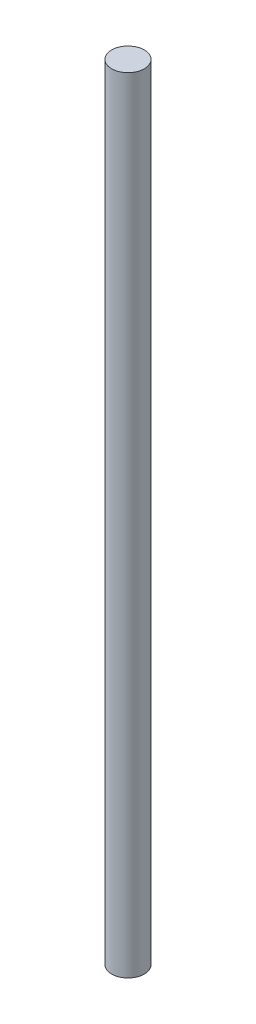
ISO-10303-21;
HEADER;
FILE_DESCRIPTION(('STEP AP214'),'2;1');
FILE_NAME('part.step','',(''),(''),'','','');
FILE_SCHEMA(('AUTOMOTIVE_DESIGN { 1 0 10303 214 1 1 1 1 }'));
ENDSEC;
DATA;
#1=APPLICATION_CONTEXT('core data for automotive mechanical design processes');
#2=APPLICATION_PROTOCOL_DEFINITION('international standard','automotive_design',2000,#1);
#3=PRODUCT_CONTEXT('',#1,'mechanical');
#4=PRODUCT('Part','Part','',(#3));
#5=PRODUCT_RELATED_PRODUCT_CATEGORY('part','',(#4));
#6=PRODUCT_DEFINITION_FORMATION('','',#4);
#7=PRODUCT_DEFINITION_CONTEXT('part definition',#1,'design');
#8=PRODUCT_DEFINITION('design','',#6,#7);
#9=PRODUCT_DEFINITION_SHAPE('','',#8);
#10=(LENGTH_UNIT() NAMED_UNIT(*) SI_UNIT(.MILLI.,.METRE.));
#11=(NAMED_UNIT(*) PLANE_ANGLE_UNIT() SI_UNIT($,.RADIAN.));
#12=(NAMED_UNIT(*) SI_UNIT($,.STERADIAN.) SOLID_ANGLE_UNIT());
#13=UNCERTAINTY_MEASURE_WITH_UNIT(LENGTH_MEASURE(1.E-05),#10,'distance_accuracy_value','');
#14=(GEOMETRIC_REPRESENTATION_CONTEXT(3) GLOBAL_UNCERTAINTY_ASSIGNED_CONTEXT((#13)) GLOBAL_UNIT_ASSIGNED_CONTEXT((#10,
#11,#12)) REPRESENTATION_CONTEXT('',''));
#15=CARTESIAN_POINT('',(0.,0.,0.));
#16=DIRECTION('',(0.,0.,1.));
#17=DIRECTION('',(1.,0.,0.));
#18=AXIS2_PLACEMENT_3D('',#15,#16,#17);
#19=CARTESIAN_POINT('',(0.,120.,0.));
#20=DIRECTION('',(0.,-1.,0.));
#21=DIRECTION('',(0.,0.,-1.));
#22=AXIS2_PLACEMENT_3D('',#19,#20,#21);
#23=CYLINDRICAL_SURFACE('',#22,2.5);
#24=CARTESIAN_POINT('',(0.,120.,0.));
#25=DIRECTION('',(0.,1.,0.));
#26=DIRECTION('',(0.,0.,1.));
#27=AXIS2_PLACEMENT_3D('',#24,#25,#26);
#28=CIRCLE('',#27,2.5);
#29=CARTESIAN_POINT('',(0.,120.,2.5));
#30=VERTEX_POINT('',#29);
#31=EDGE_CURVE('E10',#30,#30,#28,.T.);
#32=ORIENTED_EDGE('',*,*,#31,.F.);
#33=EDGE_LOOP('',(#32));
#34=FACE_BOUND('',#33,.T.);
#35=CARTESIAN_POINT('',(0.,0.,0.));
#36=DIRECTION('',(0.,1.,0.));
#37=DIRECTION('',(0.,0.,1.));
#38=AXIS2_PLACEMENT_3D('',#35,#36,#37);
#39=CIRCLE('',#38,2.5);
#40=CARTESIAN_POINT('',(0.,0.,2.5));
#41=VERTEX_POINT('',#40);
#42=EDGE_CURVE('E36',#41,#41,#39,.T.);
#43=ORIENTED_EDGE('',*,*,#42,.T.);
#44=EDGE_LOOP('',(#43));
#45=FACE_BOUND('',#44,.T.);
#46=ADVANCED_FACE('F33',(#34,#45),#23,.T.);
#47=CARTESIAN_POINT('',(0.,120.,0.));
#48=DIRECTION('',(0.,1.,0.));
#49=DIRECTION('',(0.,0.,1.));
#50=AXIS2_PLACEMENT_3D('',#47,#48,#49);
#51=PLANE('',#50);
#52=ORIENTED_EDGE('',*,*,#31,.T.);
#53=EDGE_LOOP('',(#52));
#54=FACE_BOUND('',#53,.T.);
#55=ADVANCED_FACE('F48',(#54),#51,.T.);
#56=CARTESIAN_POINT('',(0.,0.,0.));
#57=DIRECTION('',(0.,1.,0.));
#58=DIRECTION('',(0.,0.,1.));
#59=AXIS2_PLACEMENT_3D('',#56,#57,#58);
#60=PLANE('',#59);
#61=ORIENTED_EDGE('',*,*,#42,.F.);
#62=EDGE_LOOP('',(#61));
#63=FACE_BOUND('',#62,.T.);
#64=ADVANCED_FACE('F46',(#63),#60,.F.);
#65=CLOSED_SHELL('',(#46,#55,#64));
#66=MANIFOLD_SOLID_BREP('B2',#65);
#67=ADVANCED_BREP_SHAPE_REPRESENTATION('',(#18,#66),#14);
#68=SHAPE_DEFINITION_REPRESENTATION(#9,#67);
ENDSEC;
END-ISO-10303-21;
